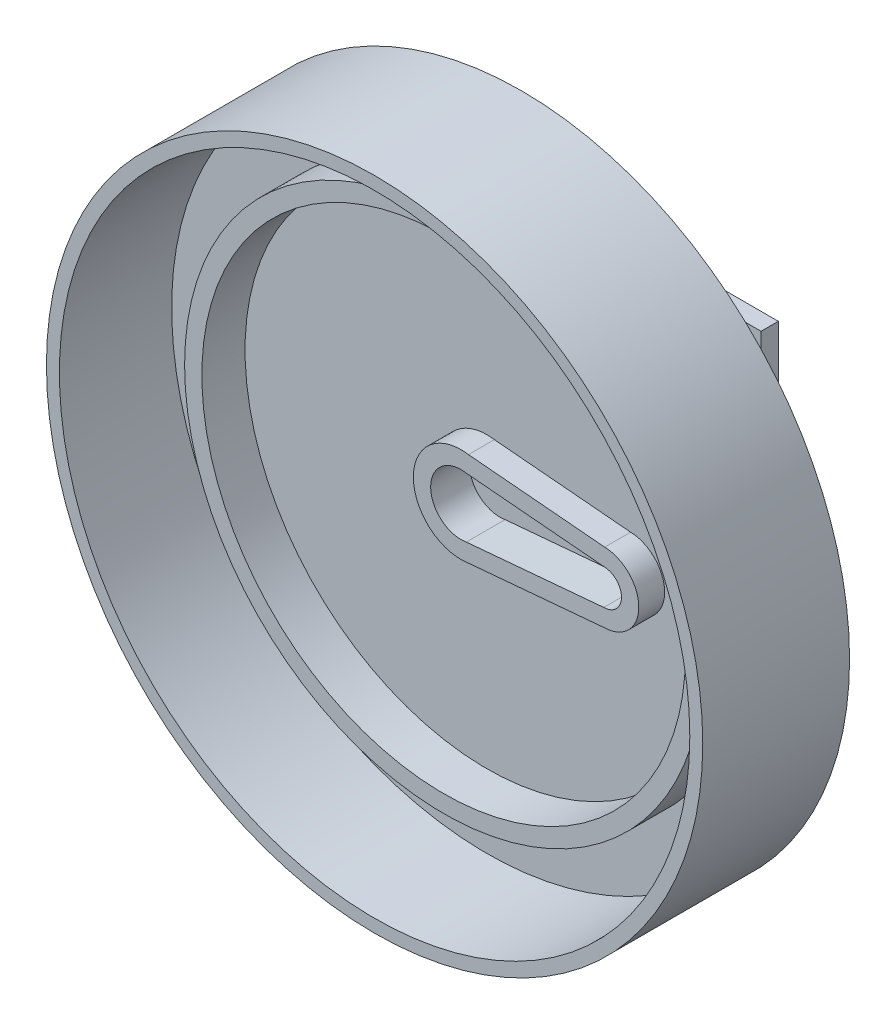
ISO-10303-21;
HEADER;
FILE_DESCRIPTION(('STEP AP214'),'2;1');
FILE_NAME('part.step','',(''),(''),'','','');
FILE_SCHEMA(('AUTOMOTIVE_DESIGN { 1 0 10303 214 1 1 1 1 }'));
ENDSEC;
DATA;
#1=APPLICATION_CONTEXT('core data for automotive mechanical design processes');
#2=APPLICATION_PROTOCOL_DEFINITION('international standard','automotive_design',2000,#1);
#3=PRODUCT_CONTEXT('',#1,'mechanical');
#4=PRODUCT('Part','Part','',(#3));
#5=PRODUCT_RELATED_PRODUCT_CATEGORY('part','',(#4));
#6=PRODUCT_DEFINITION_FORMATION('','',#4);
#7=PRODUCT_DEFINITION_CONTEXT('part definition',#1,'design');
#8=PRODUCT_DEFINITION('design','',#6,#7);
#9=PRODUCT_DEFINITION_SHAPE('','',#8);
#10=(LENGTH_UNIT() NAMED_UNIT(*) SI_UNIT(.MILLI.,.METRE.));
#11=(NAMED_UNIT(*) PLANE_ANGLE_UNIT() SI_UNIT($,.RADIAN.));
#12=(NAMED_UNIT(*) SI_UNIT($,.STERADIAN.) SOLID_ANGLE_UNIT());
#13=UNCERTAINTY_MEASURE_WITH_UNIT(LENGTH_MEASURE(1.E-05),#10,'distance_accuracy_value','');
#14=(GEOMETRIC_REPRESENTATION_CONTEXT(3) GLOBAL_UNCERTAINTY_ASSIGNED_CONTEXT((#13)) GLOBAL_UNIT_ASSIGNED_CONTEXT((#10,
#11,#12)) REPRESENTATION_CONTEXT('',''));
#15=CARTESIAN_POINT('',(0.,0.,0.));
#16=DIRECTION('',(0.,0.,1.));
#17=DIRECTION('',(1.,0.,0.));
#18=AXIS2_PLACEMENT_3D('',#15,#16,#17);
#19=CARTESIAN_POINT('',(0.,0.,0.));
#20=DIRECTION('',(0.,0.,-1.));
#21=DIRECTION('',(-1.,0.,0.));
#22=AXIS2_PLACEMENT_3D('',#19,#20,#21);
#23=PLANE('',#22);
#24=CARTESIAN_POINT('',(0.,0.,0.));
#25=DIRECTION('',(0.,0.,1.));
#26=DIRECTION('',(1.,0.,0.));
#27=AXIS2_PLACEMENT_3D('',#24,#25,#26);
#28=CIRCLE('',#27,28.);
#29=CARTESIAN_POINT('',(28.,0.,0.));
#30=VERTEX_POINT('',#29);
#31=EDGE_CURVE('E312',#30,#30,#28,.T.);
#32=ORIENTED_EDGE('',*,*,#31,.T.);
#33=EDGE_LOOP('',(#32));
#34=FACE_BOUND('',#33,.T.);
#35=CARTESIAN_POINT('',(0.,0.,0.));
#36=DIRECTION('',(0.,0.,1.));
#37=DIRECTION('',(1.,0.,0.));
#38=AXIS2_PLACEMENT_3D('',#35,#36,#37);
#39=CIRCLE('',#38,5.51);
#40=CARTESIAN_POINT('',(0.868619611934575,5.44110282661177,0.));
#41=VERTEX_POINT('',#40);
#42=CARTESIAN_POINT('',(0.868619611934588,-5.44110282661177,0.));
#43=VERTEX_POINT('',#42);
#44=EDGE_CURVE('E275',#41,#43,#39,.T.);
#45=ORIENTED_EDGE('',*,*,#44,.F.);
#46=DIRECTION('',(0.996126747672036,-0.0879289632165158,0.));
#47=VECTOR('',#46,1.);
#48=CARTESIAN_POINT('',(0.868619611934575,5.44110282661177,0.));
#49=LINE('',#48,#47);
#50=CARTESIAN_POINT('',(16.6429155328104,4.048692183052,0.));
#51=VERTEX_POINT('',#50);
#52=EDGE_CURVE('E279',#41,#51,#49,.T.);
#53=ORIENTED_EDGE('',*,*,#52,.T.);
#54=CARTESIAN_POINT('',(16.54,0.,0.));
#55=DIRECTION('',(0.,0.,1.));
#56=DIRECTION('',(1.,0.,0.));
#57=AXIS2_PLACEMENT_3D('',#54,#55,#56);
#58=CIRCLE('',#57,4.05);
#59=CARTESIAN_POINT('',(16.6429155328104,-4.048692183052,0.));
#60=VERTEX_POINT('',#59);
#61=EDGE_CURVE('E293',#60,#51,#58,.T.);
#62=ORIENTED_EDGE('',*,*,#61,.F.);
#63=DIRECTION('',(-0.996126747672036,-0.0879289632165159,0.));
#64=VECTOR('',#63,1.);
#65=CARTESIAN_POINT('',(16.6429155328104,-4.048692183052,0.));
#66=LINE('',#65,#64);
#67=EDGE_CURVE('E290',#60,#43,#66,.T.);
#68=ORIENTED_EDGE('',*,*,#67,.T.);
#69=EDGE_LOOP('',(#45,#53,#62,#68));
#70=FACE_BOUND('',#69,.T.);
#71=ADVANCED_FACE('F64',(#34,#70),#23,.F.);
#72=CARTESIAN_POINT('',(0.,0.,5.));
#73=DIRECTION('',(0.,0.,-1.));
#74=DIRECTION('',(-1.,0.,0.));
#75=AXIS2_PLACEMENT_3D('',#72,#73,#74);
#76=CYLINDRICAL_SURFACE('',#75,28.);
#77=CARTESIAN_POINT('',(0.,0.,5.));
#78=DIRECTION('',(0.,0.,1.));
#79=DIRECTION('',(1.,0.,0.));
#80=AXIS2_PLACEMENT_3D('',#77,#78,#79);
#81=CIRCLE('',#80,28.);
#82=CARTESIAN_POINT('',(28.,0.,5.));
#83=VERTEX_POINT('',#82);
#84=EDGE_CURVE('E73',#83,#83,#81,.T.);
#85=ORIENTED_EDGE('',*,*,#84,.T.);
#86=EDGE_LOOP('',(#85));
#87=FACE_BOUND('',#86,.T.);
#88=ORIENTED_EDGE('',*,*,#31,.F.);
#89=EDGE_LOOP('',(#88));
#90=FACE_BOUND('',#89,.T.);
#91=ADVANCED_FACE('F66',(#87,#90),#76,.F.);
#92=CARTESIAN_POINT('',(0.,0.,5.));
#93=DIRECTION('',(0.,0.,-1.));
#94=DIRECTION('',(-1.,0.,0.));
#95=AXIS2_PLACEMENT_3D('',#92,#93,#94);
#96=CYLINDRICAL_SURFACE('',#95,30.);
#97=CARTESIAN_POINT('',(0.,0.,5.));
#98=DIRECTION('',(0.,0.,1.));
#99=DIRECTION('',(1.,0.,0.));
#100=AXIS2_PLACEMENT_3D('',#97,#98,#99);
#101=CIRCLE('',#100,30.);
#102=CARTESIAN_POINT('',(30.,0.,5.));
#103=VERTEX_POINT('',#102);
#104=EDGE_CURVE('E12',#103,#103,#101,.T.);
#105=ORIENTED_EDGE('',*,*,#104,.F.);
#106=EDGE_LOOP('',(#105));
#107=FACE_BOUND('',#106,.T.);
#108=CARTESIAN_POINT('',(0.,0.,0.));
#109=DIRECTION('',(0.,0.,1.));
#110=DIRECTION('',(1.,0.,0.));
#111=AXIS2_PLACEMENT_3D('',#108,#109,#110);
#112=CIRCLE('',#111,30.);
#113=CARTESIAN_POINT('',(30.,0.,0.));
#114=VERTEX_POINT('',#113);
#115=EDGE_CURVE('E68',#114,#114,#112,.T.);
#116=ORIENTED_EDGE('',*,*,#115,.T.);
#117=EDGE_LOOP('',(#116));
#118=FACE_BOUND('',#117,.T.);
#119=ADVANCED_FACE('F319',(#107,#118),#96,.T.);
#120=CARTESIAN_POINT('',(0.,0.,5.));
#121=DIRECTION('',(0.,0.,1.));
#122=DIRECTION('',(1.,0.,0.));
#123=AXIS2_PLACEMENT_3D('',#120,#121,#122);
#124=PLANE('',#123);
#125=ORIENTED_EDGE('',*,*,#84,.F.);
#126=EDGE_LOOP('',(#125));
#127=FACE_BOUND('',#126,.T.);
#128=ORIENTED_EDGE('',*,*,#104,.T.);
#129=EDGE_LOOP('',(#128));
#130=FACE_BOUND('',#129,.T.);
#131=ADVANCED_FACE('F324',(#127,#130),#124,.T.);
#132=CARTESIAN_POINT('',(0.,0.,0.));
#133=DIRECTION('',(0.,0.,1.));
#134=DIRECTION('',(1.,0.,0.));
#135=AXIS2_PLACEMENT_3D('',#132,#133,#134);
#136=CIRCLE('',#135,36.5);
#137=CARTESIAN_POINT('',(36.5,0.,0.));
#138=VERTEX_POINT('',#137);
#139=EDGE_CURVE('E305',#138,#138,#136,.T.);
#140=ORIENTED_EDGE('',*,*,#139,.T.);
#141=EDGE_LOOP('',(#140));
#142=FACE_BOUND('',#141,.T.);
#143=ORIENTED_EDGE('',*,*,#115,.F.);
#144=EDGE_LOOP('',(#143));
#145=FACE_BOUND('',#144,.T.);
#146=ADVANCED_FACE('F321',(#142,#145),#23,.F.);
#147=CARTESIAN_POINT('',(0.,0.,5.));
#148=DIRECTION('',(0.,0.,-1.));
#149=DIRECTION('',(-1.,0.,0.));
#150=AXIS2_PLACEMENT_3D('',#147,#148,#149);
#151=CYLINDRICAL_SURFACE('',#150,36.5);
#152=ORIENTED_EDGE('',*,*,#139,.F.);
#153=EDGE_LOOP('',(#152));
#154=FACE_BOUND('',#153,.T.);
#155=CARTESIAN_POINT('',(0.,0.,13.));
#156=DIRECTION('',(0.,0.,1.));
#157=DIRECTION('',(1.,0.,0.));
#158=AXIS2_PLACEMENT_3D('',#155,#156,#157);
#159=CIRCLE('',#158,36.5);
#160=CARTESIAN_POINT('',(36.5,0.,13.));
#161=VERTEX_POINT('',#160);
#162=EDGE_CURVE('E238',#161,#161,#159,.T.);
#163=ORIENTED_EDGE('',*,*,#162,.T.);
#164=EDGE_LOOP('',(#163));
#165=FACE_BOUND('',#164,.T.);
#166=ADVANCED_FACE('F323',(#154,#165),#151,.F.);
#167=CARTESIAN_POINT('',(0.,0.,3.));
#168=DIRECTION('',(0.,0.,1.));
#169=DIRECTION('',(1.,0.,0.));
#170=AXIS2_PLACEMENT_3D('',#167,#168,#169);
#171=PLANE('',#170);
#172=CARTESIAN_POINT('',(0.,0.,3.));
#173=DIRECTION('',(0.,0.,1.));
#174=DIRECTION('',(1.,0.,0.));
#175=AXIS2_PLACEMENT_3D('',#172,#173,#174);
#176=CIRCLE('',#175,5.51);
#177=CARTESIAN_POINT('',(0.868619611934575,5.44110282661177,3.));
#178=VERTEX_POINT('',#177);
#179=CARTESIAN_POINT('',(0.868619611934588,-5.44110282661177,3.));
#180=VERTEX_POINT('',#179);
#181=EDGE_CURVE('E276',#178,#180,#176,.T.);
#182=ORIENTED_EDGE('',*,*,#181,.T.);
#183=DIRECTION('',(-0.996126747672036,-0.0879289632165159,0.));
#184=VECTOR('',#183,1.);
#185=CARTESIAN_POINT('',(16.6429155328104,-4.048692183052,3.));
#186=LINE('',#185,#184);
#187=CARTESIAN_POINT('',(16.6429155328104,-4.048692183052,3.));
#188=VERTEX_POINT('',#187);
#189=EDGE_CURVE('E278',#188,#180,#186,.T.);
#190=ORIENTED_EDGE('',*,*,#189,.F.);
#191=CARTESIAN_POINT('',(16.54,0.,3.));
#192=DIRECTION('',(0.,0.,1.));
#193=DIRECTION('',(1.,0.,0.));
#194=AXIS2_PLACEMENT_3D('',#191,#192,#193);
#195=CIRCLE('',#194,4.05);
#196=CARTESIAN_POINT('',(16.6429155328104,4.048692183052,3.));
#197=VERTEX_POINT('',#196);
#198=EDGE_CURVE('E282',#188,#197,#195,.T.);
#199=ORIENTED_EDGE('',*,*,#198,.T.);
#200=DIRECTION('',(0.996126747672036,-0.0879289632165158,0.));
#201=VECTOR('',#200,1.);
#202=CARTESIAN_POINT('',(0.868619611934575,5.44110282661177,3.));
#203=LINE('',#202,#201);
#204=EDGE_CURVE('E284',#178,#197,#203,.T.);
#205=ORIENTED_EDGE('',*,*,#204,.F.);
#206=EDGE_LOOP('',(#182,#190,#199,#205));
#207=FACE_BOUND('',#206,.T.);
#208=DIRECTION('',(0.996126747672036,-0.0879289632165159,0.));
#209=VECTOR('',#208,1.);
#210=CARTESIAN_POINT('',(0.61487051292839,3.45572485194223,3.));
#211=LINE('',#210,#209);
#212=CARTESIAN_POINT('',(0.614870512928391,3.45572485194223,3.));
#213=VERTEX_POINT('',#212);
#214=CARTESIAN_POINT('',(16.54,2.05,3.));
#215=VERTEX_POINT('',#214);
#216=EDGE_CURVE('E258',#213,#215,#211,.T.);
#217=ORIENTED_EDGE('',*,*,#216,.T.);
#218=CARTESIAN_POINT('',(16.54,0.,3.));
#219=DIRECTION('',(0.,0.,1.));
#220=DIRECTION('',(1.,0.,0.));
#221=AXIS2_PLACEMENT_3D('',#218,#219,#220);
#222=CIRCLE('',#221,2.05);
#223=CARTESIAN_POINT('',(16.54,-2.05,3.));
#224=VERTEX_POINT('',#223);
#225=EDGE_CURVE('E256',#224,#215,#222,.T.);
#226=ORIENTED_EDGE('',*,*,#225,.F.);
#227=DIRECTION('',(-0.996126747672036,-0.0879289632165158,0.));
#228=VECTOR('',#227,1.);
#229=CARTESIAN_POINT('',(16.54,-2.05,3.));
#230=LINE('',#229,#228);
#231=CARTESIAN_POINT('',(0.614870512928395,-3.45572485194223,3.));
#232=VERTEX_POINT('',#231);
#233=EDGE_CURVE('E264',#224,#232,#230,.T.);
#234=ORIENTED_EDGE('',*,*,#233,.T.);
#235=CARTESIAN_POINT('',(0.,0.,3.));
#236=DIRECTION('',(0.,0.,1.));
#237=DIRECTION('',(1.,0.,0.));
#238=AXIS2_PLACEMENT_3D('',#235,#236,#237);
#239=CIRCLE('',#238,3.51);
#240=EDGE_CURVE('E261',#213,#232,#239,.T.);
#241=ORIENTED_EDGE('',*,*,#240,.F.);
#242=EDGE_LOOP('',(#217,#226,#234,#241));
#243=FACE_BOUND('',#242,.T.);
#244=ADVANCED_FACE('F331',(#207,#243),#171,.T.);
#245=CARTESIAN_POINT('',(0.,0.,3.));
#246=DIRECTION('',(0.,0.,-1.));
#247=DIRECTION('',(-1.,0.,0.));
#248=AXIS2_PLACEMENT_3D('',#245,#246,#247);
#249=CYLINDRICAL_SURFACE('',#248,5.51);
#250=ORIENTED_EDGE('',*,*,#44,.T.);
#251=DIRECTION('',(0.,0.,-1.));
#252=VECTOR('',#251,1.);
#253=CARTESIAN_POINT('',(0.868619611934588,-5.44110282661177,3.));
#254=LINE('',#253,#252);
#255=EDGE_CURVE('E303',#180,#43,#254,.T.);
#256=ORIENTED_EDGE('',*,*,#255,.F.);
#257=ORIENTED_EDGE('',*,*,#181,.F.);
#258=DIRECTION('',(0.,0.,-1.));
#259=VECTOR('',#258,1.);
#260=CARTESIAN_POINT('',(0.868619611934575,5.44110282661177,3.));
#261=LINE('',#260,#259);
#262=EDGE_CURVE('E287',#178,#41,#261,.T.);
#263=ORIENTED_EDGE('',*,*,#262,.T.);
#264=EDGE_LOOP('',(#250,#256,#257,#263));
#265=FACE_BOUND('',#264,.T.);
#266=ADVANCED_FACE('F350',(#265),#249,.T.);
#267=CARTESIAN_POINT('',(16.6429155328104,-4.048692183052,3.));
#268=DIRECTION('',(0.0879289632165159,-0.996126747672036,0.));
#269=DIRECTION('',(0.996126747672036,0.0879289632165159,0.));
#270=AXIS2_PLACEMENT_3D('',#267,#268,#269);
#271=PLANE('',#270);
#272=ORIENTED_EDGE('',*,*,#67,.F.);
#273=DIRECTION('',(0.,0.,-1.));
#274=VECTOR('',#273,1.);
#275=CARTESIAN_POINT('',(16.6429155328104,-4.048692183052,3.));
#276=LINE('',#275,#274);
#277=EDGE_CURVE('E301',#188,#60,#276,.T.);
#278=ORIENTED_EDGE('',*,*,#277,.F.);
#279=ORIENTED_EDGE('',*,*,#189,.T.);
#280=ORIENTED_EDGE('',*,*,#255,.T.);
#281=EDGE_LOOP('',(#272,#278,#279,#280));
#282=FACE_BOUND('',#281,.T.);
#283=ADVANCED_FACE('F361',(#282),#271,.T.);
#284=CARTESIAN_POINT('',(16.54,0.,3.));
#285=DIRECTION('',(0.,0.,-1.));
#286=DIRECTION('',(-1.,0.,0.));
#287=AXIS2_PLACEMENT_3D('',#284,#285,#286);
#288=CYLINDRICAL_SURFACE('',#287,4.05);
#289=ORIENTED_EDGE('',*,*,#61,.T.);
#290=DIRECTION('',(0.,0.,-1.));
#291=VECTOR('',#290,1.);
#292=CARTESIAN_POINT('',(16.6429155328104,4.048692183052,3.));
#293=LINE('',#292,#291);
#294=EDGE_CURVE('E298',#197,#51,#293,.T.);
#295=ORIENTED_EDGE('',*,*,#294,.F.);
#296=ORIENTED_EDGE('',*,*,#198,.F.);
#297=ORIENTED_EDGE('',*,*,#277,.T.);
#298=EDGE_LOOP('',(#289,#295,#296,#297));
#299=FACE_BOUND('',#298,.T.);
#300=ADVANCED_FACE('F358',(#299),#288,.T.);
#301=CARTESIAN_POINT('',(0.868619611934575,5.44110282661177,3.));
#302=DIRECTION('',(0.0879289632165159,0.996126747672036,0.));
#303=DIRECTION('',(-0.996126747672036,0.0879289632165159,0.));
#304=AXIS2_PLACEMENT_3D('',#301,#302,#303);
#305=PLANE('',#304);
#306=ORIENTED_EDGE('',*,*,#52,.F.);
#307=ORIENTED_EDGE('',*,*,#262,.F.);
#308=ORIENTED_EDGE('',*,*,#204,.T.);
#309=ORIENTED_EDGE('',*,*,#294,.T.);
#310=EDGE_LOOP('',(#306,#307,#308,#309));
#311=FACE_BOUND('',#310,.T.);
#312=ADVANCED_FACE('F354',(#311),#305,.T.);
#313=CARTESIAN_POINT('',(16.54,0.,3.));
#314=DIRECTION('',(0.,0.,-1.));
#315=DIRECTION('',(-1.,0.,0.));
#316=AXIS2_PLACEMENT_3D('',#313,#314,#315);
#317=CYLINDRICAL_SURFACE('',#316,2.05);
#318=DIRECTION('',(0.,0.,-1.));
#319=VECTOR('',#318,1.);
#320=CARTESIAN_POINT('',(16.54,2.05,3.));
#321=LINE('',#320,#319);
#322=CARTESIAN_POINT('',(16.54,2.05,-1.5));
#323=VERTEX_POINT('',#322);
#324=EDGE_CURVE('E273',#215,#323,#321,.T.);
#325=ORIENTED_EDGE('',*,*,#324,.T.);
#326=CARTESIAN_POINT('',(16.54,0.,-1.5));
#327=DIRECTION('',(0.,0.,1.));
#328=DIRECTION('',(1.,0.,0.));
#329=AXIS2_PLACEMENT_3D('',#326,#327,#328);
#330=CIRCLE('',#329,2.05);
#331=CARTESIAN_POINT('',(16.54,-2.05,-1.5));
#332=VERTEX_POINT('',#331);
#333=EDGE_CURVE('E250',#332,#323,#330,.T.);
#334=ORIENTED_EDGE('',*,*,#333,.F.);
#335=DIRECTION('',(0.,0.,-1.));
#336=VECTOR('',#335,1.);
#337=CARTESIAN_POINT('',(16.54,-2.05,3.));
#338=LINE('',#337,#336);
#339=EDGE_CURVE('E267',#224,#332,#338,.T.);
#340=ORIENTED_EDGE('',*,*,#339,.F.);
#341=ORIENTED_EDGE('',*,*,#225,.T.);
#342=EDGE_LOOP('',(#325,#334,#340,#341));
#343=FACE_BOUND('',#342,.T.);
#344=ADVANCED_FACE('F376',(#343),#317,.F.);
#345=CARTESIAN_POINT('',(0.61487051292839,3.45572485194223,3.));
#346=DIRECTION('',(0.0879289632165159,0.996126747672036,0.));
#347=DIRECTION('',(-0.996126747672036,0.0879289632165159,0.));
#348=AXIS2_PLACEMENT_3D('',#345,#346,#347);
#349=PLANE('',#348);
#350=DIRECTION('',(0.,0.,-1.));
#351=VECTOR('',#350,1.);
#352=CARTESIAN_POINT('',(0.614870512928391,3.45572485194223,3.));
#353=LINE('',#352,#351);
#354=CARTESIAN_POINT('',(0.614870512928395,3.45572485194223,-1.5));
#355=VERTEX_POINT('',#354);
#356=EDGE_CURVE('E271',#213,#355,#353,.T.);
#357=ORIENTED_EDGE('',*,*,#356,.T.);
#358=DIRECTION('',(-0.996126747672036,0.0879289632165158,0.));
#359=VECTOR('',#358,1.);
#360=CARTESIAN_POINT('',(0.614870512928395,3.45572485194223,-1.5));
#361=LINE('',#360,#359);
#362=EDGE_CURVE('E253',#323,#355,#361,.T.);
#363=ORIENTED_EDGE('',*,*,#362,.F.);
#364=ORIENTED_EDGE('',*,*,#324,.F.);
#365=ORIENTED_EDGE('',*,*,#216,.F.);
#366=EDGE_LOOP('',(#357,#363,#364,#365));
#367=FACE_BOUND('',#366,.T.);
#368=ADVANCED_FACE('F371',(#367),#349,.F.);
#369=CARTESIAN_POINT('',(0.,0.,3.));
#370=DIRECTION('',(0.,0.,-1.));
#371=DIRECTION('',(-1.,0.,0.));
#372=AXIS2_PLACEMENT_3D('',#369,#370,#371);
#373=CYLINDRICAL_SURFACE('',#372,3.51);
#374=DIRECTION('',(0.,0.,-1.));
#375=VECTOR('',#374,1.);
#376=CARTESIAN_POINT('',(0.614870512928395,-3.45572485194223,3.));
#377=LINE('',#376,#375);
#378=CARTESIAN_POINT('',(0.614870512928395,-3.45572485194223,-1.5));
#379=VERTEX_POINT('',#378);
#380=EDGE_CURVE('E269',#232,#379,#377,.T.);
#381=ORIENTED_EDGE('',*,*,#380,.T.);
#382=CARTESIAN_POINT('',(0.,0.,-1.5));
#383=DIRECTION('',(0.,0.,1.));
#384=DIRECTION('',(1.,0.,0.));
#385=AXIS2_PLACEMENT_3D('',#382,#383,#384);
#386=CIRCLE('',#385,3.51);
#387=EDGE_CURVE('E244',#355,#379,#386,.T.);
#388=ORIENTED_EDGE('',*,*,#387,.F.);
#389=ORIENTED_EDGE('',*,*,#356,.F.);
#390=ORIENTED_EDGE('',*,*,#240,.T.);
#391=EDGE_LOOP('',(#381,#388,#389,#390));
#392=FACE_BOUND('',#391,.T.);
#393=ADVANCED_FACE('F384',(#392),#373,.F.);
#394=CARTESIAN_POINT('',(16.54,-2.05,3.));
#395=DIRECTION('',(0.0879289632165158,-0.996126747672036,0.));
#396=DIRECTION('',(0.996126747672036,0.0879289632165158,0.));
#397=AXIS2_PLACEMENT_3D('',#394,#395,#396);
#398=PLANE('',#397);
#399=ORIENTED_EDGE('',*,*,#339,.T.);
#400=DIRECTION('',(0.996126747672036,0.0879289632165158,0.));
#401=VECTOR('',#400,1.);
#402=CARTESIAN_POINT('',(16.54,-2.05,-1.5));
#403=LINE('',#402,#401);
#404=EDGE_CURVE('E247',#379,#332,#403,.T.);
#405=ORIENTED_EDGE('',*,*,#404,.F.);
#406=ORIENTED_EDGE('',*,*,#380,.F.);
#407=ORIENTED_EDGE('',*,*,#233,.F.);
#408=EDGE_LOOP('',(#399,#405,#406,#407));
#409=FACE_BOUND('',#408,.T.);
#410=ADVANCED_FACE('F381',(#409),#398,.F.);
#411=CARTESIAN_POINT('',(0.,0.,-1.5));
#412=DIRECTION('',(0.,0.,1.));
#413=DIRECTION('',(1.,0.,0.));
#414=AXIS2_PLACEMENT_3D('',#411,#412,#413);
#415=PLANE('',#414);
#416=ORIENTED_EDGE('',*,*,#387,.T.);
#417=ORIENTED_EDGE('',*,*,#404,.T.);
#418=ORIENTED_EDGE('',*,*,#333,.T.);
#419=ORIENTED_EDGE('',*,*,#362,.T.);
#420=EDGE_LOOP('',(#416,#417,#418,#419));
#421=FACE_BOUND('',#420,.T.);
#422=ADVANCED_FACE('F378',(#421),#415,.T.);
#423=CARTESIAN_POINT('',(0.,0.,13.));
#424=DIRECTION('',(0.,0.,1.));
#425=DIRECTION('',(1.,0.,0.));
#426=AXIS2_PLACEMENT_3D('',#423,#424,#425);
#427=PLANE('',#426);
#428=CARTESIAN_POINT('',(0.,0.,13.));
#429=DIRECTION('',(0.,0.,1.));
#430=DIRECTION('',(1.,0.,0.));
#431=AXIS2_PLACEMENT_3D('',#428,#429,#430);
#432=CIRCLE('',#431,38.);
#433=CARTESIAN_POINT('',(38.,0.,13.));
#434=VERTEX_POINT('',#433);
#435=EDGE_CURVE('E241',#434,#434,#432,.T.);
#436=ORIENTED_EDGE('',*,*,#435,.T.);
#437=EDGE_LOOP('',(#436));
#438=FACE_BOUND('',#437,.T.);
#439=ORIENTED_EDGE('',*,*,#162,.F.);
#440=EDGE_LOOP('',(#439));
#441=FACE_BOUND('',#440,.T.);
#442=ADVANCED_FACE('F407',(#438,#441),#427,.T.);
#443=CARTESIAN_POINT('',(0.,0.,-4.));
#444=DIRECTION('',(0.,0.,-1.));
#445=DIRECTION('',(-1.,0.,0.));
#446=AXIS2_PLACEMENT_3D('',#443,#444,#445);
#447=PLANE('',#446);
#448=DIRECTION('',(0.,1.,0.));
#449=VECTOR('',#448,1.);
#450=CARTESIAN_POINT('',(-10.,10.,-4.));
#451=LINE('',#450,#449);
#452=CARTESIAN_POINT('',(-10.,-10.,-4.));
#453=VERTEX_POINT('',#452);
#454=CARTESIAN_POINT('',(-10.,10.,-4.));
#455=VERTEX_POINT('',#454);
#456=EDGE_CURVE('E81',#453,#455,#451,.T.);
#457=ORIENTED_EDGE('',*,*,#456,.F.);
#458=DIRECTION('',(-1.,0.,0.));
#459=VECTOR('',#458,1.);
#460=CARTESIAN_POINT('',(10.,-10.,-4.));
#461=LINE('',#460,#459);
#462=CARTESIAN_POINT('',(10.,-10.,-4.));
#463=VERTEX_POINT('',#462);
#464=EDGE_CURVE('E85',#463,#453,#461,.T.);
#465=ORIENTED_EDGE('',*,*,#464,.F.);
#466=DIRECTION('',(0.,-1.,0.));
#467=VECTOR('',#466,1.);
#468=CARTESIAN_POINT('',(10.,10.,-4.));
#469=LINE('',#468,#467);
#470=CARTESIAN_POINT('',(10.,10.,-4.));
#471=VERTEX_POINT('',#470);
#472=EDGE_CURVE('E224',#471,#463,#469,.T.);
#473=ORIENTED_EDGE('',*,*,#472,.F.);
#474=DIRECTION('',(1.,0.,0.));
#475=VECTOR('',#474,1.);
#476=CARTESIAN_POINT('',(10.,10.,-4.));
#477=LINE('',#476,#475);
#478=EDGE_CURVE('E203',#455,#471,#477,.T.);
#479=ORIENTED_EDGE('',*,*,#478,.F.);
#480=EDGE_LOOP('',(#457,#465,#473,#479));
#481=FACE_BOUND('',#480,.T.);
#482=CARTESIAN_POINT('',(0.,0.,-4.));
#483=DIRECTION('',(0.,0.,-1.));
#484=DIRECTION('',(-1.,0.,0.));
#485=AXIS2_PLACEMENT_3D('',#482,#483,#484);
#486=CIRCLE('',#485,38.);
#487=CARTESIAN_POINT('',(-38.,0.,-4.));
#488=VERTEX_POINT('',#487);
#489=EDGE_CURVE('E308',#488,#488,#486,.T.);
#490=ORIENTED_EDGE('',*,*,#489,.T.);
#491=EDGE_LOOP('',(#490));
#492=FACE_BOUND('',#491,.T.);
#493=ADVANCED_FACE('F404',(#481,#492),#447,.T.);
#494=CARTESIAN_POINT('',(0.,0.,-4.));
#495=DIRECTION('',(0.,0.,1.));
#496=DIRECTION('',(1.,0.,0.));
#497=AXIS2_PLACEMENT_3D('',#494,#495,#496);
#498=CYLINDRICAL_SURFACE('',#497,38.);
#499=ORIENTED_EDGE('',*,*,#489,.F.);
#500=EDGE_LOOP('',(#499));
#501=FACE_BOUND('',#500,.T.);
#502=ORIENTED_EDGE('',*,*,#435,.F.);
#503=EDGE_LOOP('',(#502));
#504=FACE_BOUND('',#503,.T.);
#505=ADVANCED_FACE('F406',(#501,#504),#498,.T.);
#506=CARTESIAN_POINT('',(-10.,10.,-12.));
#507=DIRECTION('',(1.,0.,0.));
#508=DIRECTION('',(0.,0.,-1.));
#509=AXIS2_PLACEMENT_3D('',#506,#507,#508);
#510=PLANE('',#509);
#511=ORIENTED_EDGE('',*,*,#456,.T.);
#512=DIRECTION('',(0.,0.,1.));
#513=VECTOR('',#512,1.);
#514=CARTESIAN_POINT('',(-10.,10.,-12.));
#515=LINE('',#514,#513);
#516=CARTESIAN_POINT('',(-10.,10.,-12.));
#517=VERTEX_POINT('',#516);
#518=EDGE_CURVE('E235',#517,#455,#515,.T.);
#519=ORIENTED_EDGE('',*,*,#518,.F.);
#520=DIRECTION('',(0.,1.,0.));
#521=VECTOR('',#520,1.);
#522=CARTESIAN_POINT('',(-10.,10.,-12.));
#523=LINE('',#522,#521);
#524=CARTESIAN_POINT('',(-10.,-10.,-12.));
#525=VERTEX_POINT('',#524);
#526=EDGE_CURVE('E209',#525,#517,#523,.T.);
#527=ORIENTED_EDGE('',*,*,#526,.F.);
#528=DIRECTION('',(0.,0.,1.));
#529=VECTOR('',#528,1.);
#530=CARTESIAN_POINT('',(-10.,-10.,-12.));
#531=LINE('',#530,#529);
#532=EDGE_CURVE('E220',#525,#453,#531,.T.);
#533=ORIENTED_EDGE('',*,*,#532,.T.);
#534=EDGE_LOOP('',(#511,#519,#527,#533));
#535=FACE_BOUND('',#534,.T.);
#536=ADVANCED_FACE('F412',(#535),#510,.F.);
#537=CARTESIAN_POINT('',(10.,10.,-12.));
#538=DIRECTION('',(0.,-1.,0.));
#539=DIRECTION('',(0.,0.,-1.));
#540=AXIS2_PLACEMENT_3D('',#537,#538,#539);
#541=PLANE('',#540);
#542=ORIENTED_EDGE('',*,*,#478,.T.);
#543=DIRECTION('',(0.,0.,1.));
#544=VECTOR('',#543,1.);
#545=CARTESIAN_POINT('',(10.,10.,-12.));
#546=LINE('',#545,#544);
#547=CARTESIAN_POINT('',(10.,10.,-12.));
#548=VERTEX_POINT('',#547);
#549=EDGE_CURVE('E232',#548,#471,#546,.T.);
#550=ORIENTED_EDGE('',*,*,#549,.F.);
#551=DIRECTION('',(1.,0.,0.));
#552=VECTOR('',#551,1.);
#553=CARTESIAN_POINT('',(10.,10.,-12.));
#554=LINE('',#553,#552);
#555=EDGE_CURVE('E212',#517,#548,#554,.T.);
#556=ORIENTED_EDGE('',*,*,#555,.F.);
#557=ORIENTED_EDGE('',*,*,#518,.T.);
#558=EDGE_LOOP('',(#542,#550,#556,#557));
#559=FACE_BOUND('',#558,.T.);
#560=ADVANCED_FACE('F429',(#559),#541,.F.);
#561=CARTESIAN_POINT('',(10.,10.,-12.));
#562=DIRECTION('',(-1.,0.,0.));
#563=DIRECTION('',(0.,0.,1.));
#564=AXIS2_PLACEMENT_3D('',#561,#562,#563);
#565=PLANE('',#564);
#566=ORIENTED_EDGE('',*,*,#472,.T.);
#567=DIRECTION('',(0.,0.,1.));
#568=VECTOR('',#567,1.);
#569=CARTESIAN_POINT('',(10.,-10.,-12.));
#570=LINE('',#569,#568);
#571=CARTESIAN_POINT('',(10.,-10.,-12.));
#572=VERTEX_POINT('',#571);
#573=EDGE_CURVE('E229',#572,#463,#570,.T.);
#574=ORIENTED_EDGE('',*,*,#573,.F.);
#575=DIRECTION('',(0.,-1.,0.));
#576=VECTOR('',#575,1.);
#577=CARTESIAN_POINT('',(10.,10.,-12.));
#578=LINE('',#577,#576);
#579=EDGE_CURVE('E215',#548,#572,#578,.T.);
#580=ORIENTED_EDGE('',*,*,#579,.F.);
#581=ORIENTED_EDGE('',*,*,#549,.T.);
#582=EDGE_LOOP('',(#566,#574,#580,#581));
#583=FACE_BOUND('',#582,.T.);
#584=ADVANCED_FACE('F433',(#583),#565,.F.);
#585=CARTESIAN_POINT('',(10.,-10.,-12.));
#586=DIRECTION('',(0.,1.,0.));
#587=DIRECTION('',(0.,0.,1.));
#588=AXIS2_PLACEMENT_3D('',#585,#586,#587);
#589=PLANE('',#588);
#590=ORIENTED_EDGE('',*,*,#464,.T.);
#591=ORIENTED_EDGE('',*,*,#532,.F.);
#592=DIRECTION('',(-1.,0.,0.));
#593=VECTOR('',#592,1.);
#594=CARTESIAN_POINT('',(10.,-10.,-12.));
#595=LINE('',#594,#593);
#596=EDGE_CURVE('E218',#572,#525,#595,.T.);
#597=ORIENTED_EDGE('',*,*,#596,.F.);
#598=ORIENTED_EDGE('',*,*,#573,.T.);
#599=EDGE_LOOP('',(#590,#591,#597,#598));
#600=FACE_BOUND('',#599,.T.);
#601=ADVANCED_FACE('F437',(#600),#589,.F.);
#602=CARTESIAN_POINT('',(0.,0.,-12.));
#603=DIRECTION('',(0.,0.,-1.));
#604=DIRECTION('',(-1.,0.,0.));
#605=AXIS2_PLACEMENT_3D('',#602,#603,#604);
#606=PLANE('',#605);
#607=DIRECTION('',(0.,1.,0.));
#608=VECTOR('',#607,1.);
#609=CARTESIAN_POINT('',(-19.75,19.75,-12.));
#610=LINE('',#609,#608);
#611=CARTESIAN_POINT('',(-19.75,-19.75,-12.));
#612=VERTEX_POINT('',#611);
#613=CARTESIAN_POINT('',(-19.75,19.75,-12.));
#614=VERTEX_POINT('',#613);
#615=EDGE_CURVE('E201',#612,#614,#610,.T.);
#616=ORIENTED_EDGE('',*,*,#615,.F.);
#617=DIRECTION('',(-1.,0.,0.));
#618=VECTOR('',#617,1.);
#619=CARTESIAN_POINT('',(19.75,-19.75,-12.));
#620=LINE('',#619,#618);
#621=CARTESIAN_POINT('',(19.75,-19.75,-12.));
#622=VERTEX_POINT('',#621);
#623=EDGE_CURVE('E197',#622,#612,#620,.T.);
#624=ORIENTED_EDGE('',*,*,#623,.F.);
#625=DIRECTION('',(0.,-1.,0.));
#626=VECTOR('',#625,1.);
#627=CARTESIAN_POINT('',(19.75,19.75,-12.));
#628=LINE('',#627,#626);
#629=CARTESIAN_POINT('',(19.75,19.75,-12.));
#630=VERTEX_POINT('',#629);
#631=EDGE_CURVE('E657',#630,#622,#628,.T.);
#632=ORIENTED_EDGE('',*,*,#631,.F.);
#633=DIRECTION('',(1.,0.,0.));
#634=VECTOR('',#633,1.);
#635=CARTESIAN_POINT('',(19.75,19.75,-12.));
#636=LINE('',#635,#634);
#637=EDGE_CURVE('E655',#614,#630,#636,.T.);
#638=ORIENTED_EDGE('',*,*,#637,.F.);
#639=EDGE_LOOP('',(#616,#624,#632,#638));
#640=FACE_BOUND('',#639,.T.);
#641=ORIENTED_EDGE('',*,*,#596,.T.);
#642=ORIENTED_EDGE('',*,*,#526,.T.);
#643=ORIENTED_EDGE('',*,*,#555,.T.);
#644=ORIENTED_EDGE('',*,*,#579,.T.);
#645=EDGE_LOOP('',(#641,#642,#643,#644));
#646=FACE_BOUND('',#645,.T.);
#647=ADVANCED_FACE('F441',(#640,#646),#606,.F.);
#648=CARTESIAN_POINT('',(-19.75,19.75,-14.));
#649=DIRECTION('',(1.,0.,0.));
#650=DIRECTION('',(0.,1.,0.));
#651=AXIS2_PLACEMENT_3D('',#648,#649,#650);
#652=PLANE('',#651);
#653=ORIENTED_EDGE('',*,*,#615,.T.);
#654=DIRECTION('',(0.,0.,1.));
#655=VECTOR('',#654,1.);
#656=CARTESIAN_POINT('',(-19.75,19.75,-14.));
#657=LINE('',#656,#655);
#658=CARTESIAN_POINT('',(-19.75,19.75,-14.));
#659=VERTEX_POINT('',#658);
#660=EDGE_CURVE('E181',#659,#614,#657,.T.);
#661=ORIENTED_EDGE('',*,*,#660,.F.);
#662=DIRECTION('',(0.,1.,0.));
#663=VECTOR('',#662,1.);
#664=CARTESIAN_POINT('',(-19.75,19.75,-14.));
#665=LINE('',#664,#663);
#666=CARTESIAN_POINT('',(-19.75,-19.75,-14.));
#667=VERTEX_POINT('',#666);
#668=EDGE_CURVE('E188',#667,#659,#665,.T.);
#669=ORIENTED_EDGE('',*,*,#668,.F.);
#670=DIRECTION('',(0.,0.,1.));
#671=VECTOR('',#670,1.);
#672=CARTESIAN_POINT('',(-19.75,-19.75,-14.));
#673=LINE('',#672,#671);
#674=EDGE_CURVE('E664',#667,#612,#673,.T.);
#675=ORIENTED_EDGE('',*,*,#674,.T.);
#676=EDGE_LOOP('',(#653,#661,#669,#675));
#677=FACE_BOUND('',#676,.T.);
#678=ADVANCED_FACE('F199',(#677),#652,.F.);
#679=CARTESIAN_POINT('',(19.75,19.75,-14.));
#680=DIRECTION('',(0.,-1.,0.));
#681=DIRECTION('',(0.,0.,-1.));
#682=AXIS2_PLACEMENT_3D('',#679,#680,#681);
#683=PLANE('',#682);
#684=ORIENTED_EDGE('',*,*,#637,.T.);
#685=DIRECTION('',(0.,0.,1.));
#686=VECTOR('',#685,1.);
#687=CARTESIAN_POINT('',(19.75,19.75,-14.));
#688=LINE('',#687,#686);
#689=CARTESIAN_POINT('',(19.75,19.75,-14.));
#690=VERTEX_POINT('',#689);
#691=EDGE_CURVE('E184',#690,#630,#688,.T.);
#692=ORIENTED_EDGE('',*,*,#691,.F.);
#693=DIRECTION('',(1.,0.,0.));
#694=VECTOR('',#693,1.);
#695=CARTESIAN_POINT('',(19.75,19.75,-14.));
#696=LINE('',#695,#694);
#697=EDGE_CURVE('E177',#659,#690,#696,.T.);
#698=ORIENTED_EDGE('',*,*,#697,.F.);
#699=ORIENTED_EDGE('',*,*,#660,.T.);
#700=EDGE_LOOP('',(#684,#692,#698,#699));
#701=FACE_BOUND('',#700,.T.);
#702=ADVANCED_FACE('F179',(#701),#683,.F.);
#703=CARTESIAN_POINT('',(19.75,19.75,-14.));
#704=DIRECTION('',(-1.,0.,0.));
#705=DIRECTION('',(0.,-1.,0.));
#706=AXIS2_PLACEMENT_3D('',#703,#704,#705);
#707=PLANE('',#706);
#708=ORIENTED_EDGE('',*,*,#631,.T.);
#709=DIRECTION('',(0.,0.,1.));
#710=VECTOR('',#709,1.);
#711=CARTESIAN_POINT('',(19.75,-19.75,-14.));
#712=LINE('',#711,#710);
#713=CARTESIAN_POINT('',(19.75,-19.75,-14.));
#714=VERTEX_POINT('',#713);
#715=EDGE_CURVE('E205',#714,#622,#712,.T.);
#716=ORIENTED_EDGE('',*,*,#715,.F.);
#717=DIRECTION('',(0.,-1.,0.));
#718=VECTOR('',#717,1.);
#719=CARTESIAN_POINT('',(19.75,19.75,-14.));
#720=LINE('',#719,#718);
#721=EDGE_CURVE('E187',#690,#714,#720,.T.);
#722=ORIENTED_EDGE('',*,*,#721,.F.);
#723=ORIENTED_EDGE('',*,*,#691,.T.);
#724=EDGE_LOOP('',(#708,#716,#722,#723));
#725=FACE_BOUND('',#724,.T.);
#726=ADVANCED_FACE('F447',(#725),#707,.F.);
#727=CARTESIAN_POINT('',(19.75,-19.75,-14.));
#728=DIRECTION('',(0.,1.,0.));
#729=DIRECTION('',(0.,0.,1.));
#730=AXIS2_PLACEMENT_3D('',#727,#728,#729);
#731=PLANE('',#730);
#732=ORIENTED_EDGE('',*,*,#623,.T.);
#733=ORIENTED_EDGE('',*,*,#674,.F.);
#734=DIRECTION('',(-1.,0.,0.));
#735=VECTOR('',#734,1.);
#736=CARTESIAN_POINT('',(19.75,-19.75,-14.));
#737=LINE('',#736,#735);
#738=EDGE_CURVE('E193',#714,#667,#737,.T.);
#739=ORIENTED_EDGE('',*,*,#738,.F.);
#740=ORIENTED_EDGE('',*,*,#715,.T.);
#741=EDGE_LOOP('',(#732,#733,#739,#740));
#742=FACE_BOUND('',#741,.T.);
#743=ADVANCED_FACE('F450',(#742),#731,.F.);
#744=CARTESIAN_POINT('',(0.,0.,-14.));
#745=DIRECTION('',(0.,0.,-1.));
#746=DIRECTION('',(-1.,0.,0.));
#747=AXIS2_PLACEMENT_3D('',#744,#745,#746);
#748=PLANE('',#747);
#749=ORIENTED_EDGE('',*,*,#668,.T.);
#750=ORIENTED_EDGE('',*,*,#697,.T.);
#751=ORIENTED_EDGE('',*,*,#721,.T.);
#752=ORIENTED_EDGE('',*,*,#738,.T.);
#753=EDGE_LOOP('',(#749,#750,#751,#752));
#754=FACE_BOUND('',#753,.T.);
#755=ADVANCED_FACE('F191',(#754),#748,.T.);
#756=CLOSED_SHELL('',(#71,#91,#119,#131,#146,#166,#244,#266,#283,#300,#312,#344,#368,#393,#410,
#422,#442,#493,#505,#536,#560,#584,#601,#647,#678,#702,#726,#743,#755));
#757=MANIFOLD_SOLID_BREP('B2',#756);
#758=ADVANCED_BREP_SHAPE_REPRESENTATION('',(#18,#757),#14);
#759=SHAPE_DEFINITION_REPRESENTATION(#9,#758);
ENDSEC;
END-ISO-10303-21;
